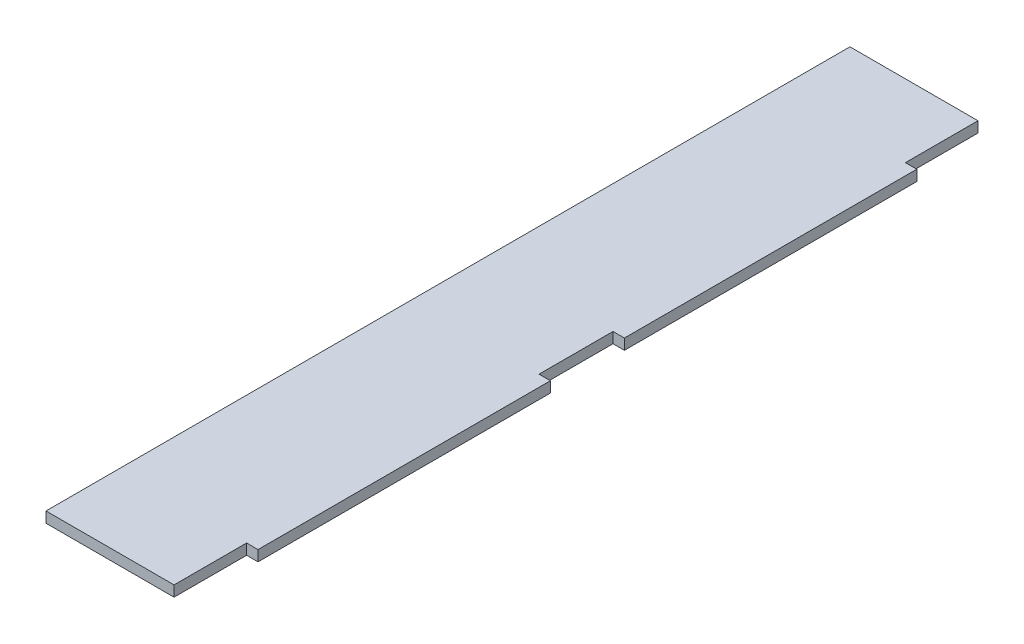
ISO-10303-21;
HEADER;
FILE_DESCRIPTION(('STEP AP214'),'2;1');
FILE_NAME('part.step','',(''),(''),'','','');
FILE_SCHEMA(('AUTOMOTIVE_DESIGN { 1 0 10303 214 1 1 1 1 }'));
ENDSEC;
DATA;
#1=APPLICATION_CONTEXT('core data for automotive mechanical design processes');
#2=APPLICATION_PROTOCOL_DEFINITION('international standard','automotive_design',2000,#1);
#3=PRODUCT_CONTEXT('',#1,'mechanical');
#4=PRODUCT('Part','Part','',(#3));
#5=PRODUCT_RELATED_PRODUCT_CATEGORY('part','',(#4));
#6=PRODUCT_DEFINITION_FORMATION('','',#4);
#7=PRODUCT_DEFINITION_CONTEXT('part definition',#1,'design');
#8=PRODUCT_DEFINITION('design','',#6,#7);
#9=PRODUCT_DEFINITION_SHAPE('','',#8);
#10=(LENGTH_UNIT() NAMED_UNIT(*) SI_UNIT(.MILLI.,.METRE.));
#11=(NAMED_UNIT(*) PLANE_ANGLE_UNIT() SI_UNIT($,.RADIAN.));
#12=(NAMED_UNIT(*) SI_UNIT($,.STERADIAN.) SOLID_ANGLE_UNIT());
#13=UNCERTAINTY_MEASURE_WITH_UNIT(LENGTH_MEASURE(1.E-05),#10,'distance_accuracy_value','');
#14=(GEOMETRIC_REPRESENTATION_CONTEXT(3) GLOBAL_UNCERTAINTY_ASSIGNED_CONTEXT((#13)) GLOBAL_UNIT_ASSIGNED_CONTEXT((#10,
#11,#12)) REPRESENTATION_CONTEXT('',''));
#15=CARTESIAN_POINT('',(0.,0.,0.));
#16=DIRECTION('',(0.,0.,1.));
#17=DIRECTION('',(1.,0.,0.));
#18=AXIS2_PLACEMENT_3D('',#15,#16,#17);
#19=CARTESIAN_POINT('',(18.,1.5,0.));
#20=DIRECTION('',(0.,0.,-1.));
#21=DIRECTION('',(-1.,0.,0.));
#22=AXIS2_PLACEMENT_3D('',#19,#20,#21);
#23=PLANE('',#22);
#24=DIRECTION('',(1.,0.,0.));
#25=VECTOR('',#24,1.);
#26=CARTESIAN_POINT('',(18.,0.,0.));
#27=LINE('',#26,#25);
#28=CARTESIAN_POINT('',(0.,0.,0.));
#29=VERTEX_POINT('',#28);
#30=CARTESIAN_POINT('',(18.,0.,0.));
#31=VERTEX_POINT('',#30);
#32=EDGE_CURVE('E153',#29,#31,#27,.T.);
#33=ORIENTED_EDGE('',*,*,#32,.T.);
#34=DIRECTION('',(0.,-1.,0.));
#35=VECTOR('',#34,1.);
#36=CARTESIAN_POINT('',(18.,1.5,0.));
#37=LINE('',#36,#35);
#38=CARTESIAN_POINT('',(18.,1.5,0.));
#39=VERTEX_POINT('',#38);
#40=EDGE_CURVE('E11',#39,#31,#37,.T.);
#41=ORIENTED_EDGE('',*,*,#40,.F.);
#42=DIRECTION('',(1.,0.,0.));
#43=VECTOR('',#42,1.);
#44=CARTESIAN_POINT('',(18.,1.5,0.));
#45=LINE('',#44,#43);
#46=CARTESIAN_POINT('',(0.,1.5,0.));
#47=VERTEX_POINT('',#46);
#48=EDGE_CURVE('E175',#47,#39,#45,.T.);
#49=ORIENTED_EDGE('',*,*,#48,.F.);
#50=DIRECTION('',(0.,-1.,0.));
#51=VECTOR('',#50,1.);
#52=CARTESIAN_POINT('',(0.,1.5,0.));
#53=LINE('',#52,#51);
#54=EDGE_CURVE('E149',#47,#29,#53,.T.);
#55=ORIENTED_EDGE('',*,*,#54,.T.);
#56=EDGE_LOOP('',(#33,#41,#49,#55));
#57=FACE_BOUND('',#56,.T.);
#58=ADVANCED_FACE('F33',(#57),#23,.F.);
#59=CARTESIAN_POINT('',(18.,1.5,-10.2));
#60=DIRECTION('',(-1.,0.,0.));
#61=DIRECTION('',(0.,0.,1.));
#62=AXIS2_PLACEMENT_3D('',#59,#60,#61);
#63=PLANE('',#62);
#64=DIRECTION('',(0.,0.,-1.));
#65=VECTOR('',#64,1.);
#66=CARTESIAN_POINT('',(18.,0.,-10.2));
#67=LINE('',#66,#65);
#68=CARTESIAN_POINT('',(18.,0.,-10.2));
#69=VERTEX_POINT('',#68);
#70=EDGE_CURVE('E156',#31,#69,#67,.T.);
#71=ORIENTED_EDGE('',*,*,#70,.T.);
#72=DIRECTION('',(0.,-1.,0.));
#73=VECTOR('',#72,1.);
#74=CARTESIAN_POINT('',(18.,1.5,-10.2));
#75=LINE('',#74,#73);
#76=CARTESIAN_POINT('',(18.,1.5,-10.2));
#77=VERTEX_POINT('',#76);
#78=EDGE_CURVE('E41',#77,#69,#75,.T.);
#79=ORIENTED_EDGE('',*,*,#78,.F.);
#80=DIRECTION('',(0.,0.,-1.));
#81=VECTOR('',#80,1.);
#82=CARTESIAN_POINT('',(18.,1.5,-10.2));
#83=LINE('',#82,#81);
#84=EDGE_CURVE('E104',#39,#77,#83,.T.);
#85=ORIENTED_EDGE('',*,*,#84,.F.);
#86=ORIENTED_EDGE('',*,*,#40,.T.);
#87=EDGE_LOOP('',(#71,#79,#85,#86));
#88=FACE_BOUND('',#87,.T.);
#89=ADVANCED_FACE('F253',(#88),#63,.F.);
#90=CARTESIAN_POINT('',(19.6,1.5,-10.2));
#91=DIRECTION('',(0.,0.,-1.));
#92=DIRECTION('',(-1.,0.,0.));
#93=AXIS2_PLACEMENT_3D('',#90,#91,#92);
#94=PLANE('',#93);
#95=DIRECTION('',(1.,0.,0.));
#96=VECTOR('',#95,1.);
#97=CARTESIAN_POINT('',(19.6,0.,-10.2));
#98=LINE('',#97,#96);
#99=CARTESIAN_POINT('',(19.6,0.,-10.2));
#100=VERTEX_POINT('',#99);
#101=EDGE_CURVE('E158',#69,#100,#98,.T.);
#102=ORIENTED_EDGE('',*,*,#101,.T.);
#103=DIRECTION('',(0.,-1.,0.));
#104=VECTOR('',#103,1.);
#105=CARTESIAN_POINT('',(19.6,1.5,-10.2));
#106=LINE('',#105,#104);
#107=CARTESIAN_POINT('',(19.6,1.5,-10.2));
#108=VERTEX_POINT('',#107);
#109=EDGE_CURVE('E194',#108,#100,#106,.T.);
#110=ORIENTED_EDGE('',*,*,#109,.F.);
#111=DIRECTION('',(1.,0.,0.));
#112=VECTOR('',#111,1.);
#113=CARTESIAN_POINT('',(19.6,1.5,-10.2));
#114=LINE('',#113,#112);
#115=EDGE_CURVE('E202',#77,#108,#114,.T.);
#116=ORIENTED_EDGE('',*,*,#115,.F.);
#117=ORIENTED_EDGE('',*,*,#78,.T.);
#118=EDGE_LOOP('',(#102,#110,#116,#117));
#119=FACE_BOUND('',#118,.T.);
#120=ADVANCED_FACE('F200',(#119),#94,.F.);
#121=CARTESIAN_POINT('',(19.6,1.5,-51.3));
#122=DIRECTION('',(-1.,0.,0.));
#123=DIRECTION('',(0.,0.,1.));
#124=AXIS2_PLACEMENT_3D('',#121,#122,#123);
#125=PLANE('',#124);
#126=DIRECTION('',(0.,0.,-1.));
#127=VECTOR('',#126,1.);
#128=CARTESIAN_POINT('',(19.6,0.,-51.3));
#129=LINE('',#128,#127);
#130=CARTESIAN_POINT('',(19.6,0.,-51.3));
#131=VERTEX_POINT('',#130);
#132=EDGE_CURVE('E160',#100,#131,#129,.T.);
#133=ORIENTED_EDGE('',*,*,#132,.T.);
#134=DIRECTION('',(0.,-1.,0.));
#135=VECTOR('',#134,1.);
#136=CARTESIAN_POINT('',(19.6,1.5,-51.3));
#137=LINE('',#136,#135);
#138=CARTESIAN_POINT('',(19.6,1.5,-51.3));
#139=VERTEX_POINT('',#138);
#140=EDGE_CURVE('E191',#139,#131,#137,.T.);
#141=ORIENTED_EDGE('',*,*,#140,.F.);
#142=DIRECTION('',(0.,0.,-1.));
#143=VECTOR('',#142,1.);
#144=CARTESIAN_POINT('',(19.6,1.5,-51.3));
#145=LINE('',#144,#143);
#146=EDGE_CURVE('E220',#108,#139,#145,.T.);
#147=ORIENTED_EDGE('',*,*,#146,.F.);
#148=ORIENTED_EDGE('',*,*,#109,.T.);
#149=EDGE_LOOP('',(#133,#141,#147,#148));
#150=FACE_BOUND('',#149,.T.);
#151=ADVANCED_FACE('F211',(#150),#125,.F.);
#152=CARTESIAN_POINT('',(18.,1.5,-51.3));
#153=DIRECTION('',(0.,0.,1.));
#154=DIRECTION('',(1.,0.,0.));
#155=AXIS2_PLACEMENT_3D('',#152,#153,#154);
#156=PLANE('',#155);
#157=DIRECTION('',(-1.,0.,0.));
#158=VECTOR('',#157,1.);
#159=CARTESIAN_POINT('',(18.,0.,-51.3));
#160=LINE('',#159,#158);
#161=CARTESIAN_POINT('',(18.,0.,-51.3));
#162=VERTEX_POINT('',#161);
#163=EDGE_CURVE('E162',#131,#162,#160,.T.);
#164=ORIENTED_EDGE('',*,*,#163,.T.);
#165=DIRECTION('',(0.,-1.,0.));
#166=VECTOR('',#165,1.);
#167=CARTESIAN_POINT('',(18.,1.5,-51.3));
#168=LINE('',#167,#166);
#169=CARTESIAN_POINT('',(18.,1.5,-51.3));
#170=VERTEX_POINT('',#169);
#171=EDGE_CURVE('E188',#170,#162,#168,.T.);
#172=ORIENTED_EDGE('',*,*,#171,.F.);
#173=DIRECTION('',(-1.,0.,0.));
#174=VECTOR('',#173,1.);
#175=CARTESIAN_POINT('',(18.,1.5,-51.3));
#176=LINE('',#175,#174);
#177=EDGE_CURVE('E217',#139,#170,#176,.T.);
#178=ORIENTED_EDGE('',*,*,#177,.F.);
#179=ORIENTED_EDGE('',*,*,#140,.T.);
#180=EDGE_LOOP('',(#164,#172,#178,#179));
#181=FACE_BOUND('',#180,.T.);
#182=ADVANCED_FACE('F215',(#181),#156,.F.);
#183=CARTESIAN_POINT('',(18.,1.5,-61.7));
#184=DIRECTION('',(-1.,0.,0.));
#185=DIRECTION('',(0.,0.,1.));
#186=AXIS2_PLACEMENT_3D('',#183,#184,#185);
#187=PLANE('',#186);
#188=DIRECTION('',(0.,0.,-1.));
#189=VECTOR('',#188,1.);
#190=CARTESIAN_POINT('',(18.,0.,-61.7));
#191=LINE('',#190,#189);
#192=CARTESIAN_POINT('',(18.,0.,-61.7));
#193=VERTEX_POINT('',#192);
#194=EDGE_CURVE('E164',#162,#193,#191,.T.);
#195=ORIENTED_EDGE('',*,*,#194,.T.);
#196=DIRECTION('',(0.,-1.,0.));
#197=VECTOR('',#196,1.);
#198=CARTESIAN_POINT('',(18.,1.5,-61.7));
#199=LINE('',#198,#197);
#200=CARTESIAN_POINT('',(18.,1.5,-61.7));
#201=VERTEX_POINT('',#200);
#202=EDGE_CURVE('E185',#201,#193,#199,.T.);
#203=ORIENTED_EDGE('',*,*,#202,.F.);
#204=DIRECTION('',(0.,0.,-1.));
#205=VECTOR('',#204,1.);
#206=CARTESIAN_POINT('',(18.,1.5,-61.7));
#207=LINE('',#206,#205);
#208=EDGE_CURVE('E219',#170,#201,#207,.T.);
#209=ORIENTED_EDGE('',*,*,#208,.F.);
#210=ORIENTED_EDGE('',*,*,#171,.T.);
#211=EDGE_LOOP('',(#195,#203,#209,#210));
#212=FACE_BOUND('',#211,.T.);
#213=ADVANCED_FACE('F266',(#212),#187,.F.);
#214=CARTESIAN_POINT('',(19.6,1.5,-61.7));
#215=DIRECTION('',(0.,0.,-1.));
#216=DIRECTION('',(-1.,0.,0.));
#217=AXIS2_PLACEMENT_3D('',#214,#215,#216);
#218=PLANE('',#217);
#219=DIRECTION('',(1.,0.,0.));
#220=VECTOR('',#219,1.);
#221=CARTESIAN_POINT('',(19.6,0.,-61.7));
#222=LINE('',#221,#220);
#223=CARTESIAN_POINT('',(19.6,0.,-61.7));
#224=VERTEX_POINT('',#223);
#225=EDGE_CURVE('E166',#193,#224,#222,.T.);
#226=ORIENTED_EDGE('',*,*,#225,.T.);
#227=DIRECTION('',(0.,-1.,0.));
#228=VECTOR('',#227,1.);
#229=CARTESIAN_POINT('',(19.6,1.5,-61.7));
#230=LINE('',#229,#228);
#231=CARTESIAN_POINT('',(19.6,1.5,-61.7));
#232=VERTEX_POINT('',#231);
#233=EDGE_CURVE('E182',#232,#224,#230,.T.);
#234=ORIENTED_EDGE('',*,*,#233,.F.);
#235=DIRECTION('',(1.,0.,0.));
#236=VECTOR('',#235,1.);
#237=CARTESIAN_POINT('',(19.6,1.5,-61.7));
#238=LINE('',#237,#236);
#239=EDGE_CURVE('E222',#201,#232,#238,.T.);
#240=ORIENTED_EDGE('',*,*,#239,.F.);
#241=ORIENTED_EDGE('',*,*,#202,.T.);
#242=EDGE_LOOP('',(#226,#234,#240,#241));
#243=FACE_BOUND('',#242,.T.);
#244=ADVANCED_FACE('F269',(#243),#218,.F.);
#245=CARTESIAN_POINT('',(19.6,1.5,-102.8));
#246=DIRECTION('',(-1.,0.,0.));
#247=DIRECTION('',(0.,0.,1.));
#248=AXIS2_PLACEMENT_3D('',#245,#246,#247);
#249=PLANE('',#248);
#250=DIRECTION('',(0.,0.,-1.));
#251=VECTOR('',#250,1.);
#252=CARTESIAN_POINT('',(19.6,0.,-102.8));
#253=LINE('',#252,#251);
#254=CARTESIAN_POINT('',(19.6,0.,-102.8));
#255=VERTEX_POINT('',#254);
#256=EDGE_CURVE('E168',#224,#255,#253,.T.);
#257=ORIENTED_EDGE('',*,*,#256,.T.);
#258=DIRECTION('',(0.,-1.,0.));
#259=VECTOR('',#258,1.);
#260=CARTESIAN_POINT('',(19.6,1.5,-102.8));
#261=LINE('',#260,#259);
#262=CARTESIAN_POINT('',(19.6,1.5,-102.8));
#263=VERTEX_POINT('',#262);
#264=EDGE_CURVE('E179',#263,#255,#261,.T.);
#265=ORIENTED_EDGE('',*,*,#264,.F.);
#266=DIRECTION('',(0.,0.,-1.));
#267=VECTOR('',#266,1.);
#268=CARTESIAN_POINT('',(19.6,1.5,-102.8));
#269=LINE('',#268,#267);
#270=EDGE_CURVE('E228',#232,#263,#269,.T.);
#271=ORIENTED_EDGE('',*,*,#270,.F.);
#272=ORIENTED_EDGE('',*,*,#233,.T.);
#273=EDGE_LOOP('',(#257,#265,#271,#272));
#274=FACE_BOUND('',#273,.T.);
#275=ADVANCED_FACE('F234',(#274),#249,.F.);
#276=CARTESIAN_POINT('',(18.,1.5,-102.8));
#277=DIRECTION('',(0.,0.,1.));
#278=DIRECTION('',(1.,0.,0.));
#279=AXIS2_PLACEMENT_3D('',#276,#277,#278);
#280=PLANE('',#279);
#281=DIRECTION('',(-1.,0.,0.));
#282=VECTOR('',#281,1.);
#283=CARTESIAN_POINT('',(18.,0.,-102.8));
#284=LINE('',#283,#282);
#285=CARTESIAN_POINT('',(18.,0.,-102.8));
#286=VERTEX_POINT('',#285);
#287=EDGE_CURVE('E170',#255,#286,#284,.T.);
#288=ORIENTED_EDGE('',*,*,#287,.T.);
#289=DIRECTION('',(0.,-1.,0.));
#290=VECTOR('',#289,1.);
#291=CARTESIAN_POINT('',(18.,1.5,-102.8));
#292=LINE('',#291,#290);
#293=CARTESIAN_POINT('',(18.,1.5,-102.8));
#294=VERTEX_POINT('',#293);
#295=EDGE_CURVE('E144',#294,#286,#292,.T.);
#296=ORIENTED_EDGE('',*,*,#295,.F.);
#297=DIRECTION('',(-1.,0.,0.));
#298=VECTOR('',#297,1.);
#299=CARTESIAN_POINT('',(18.,1.5,-102.8));
#300=LINE('',#299,#298);
#301=EDGE_CURVE('E135',#263,#294,#300,.T.);
#302=ORIENTED_EDGE('',*,*,#301,.F.);
#303=ORIENTED_EDGE('',*,*,#264,.T.);
#304=EDGE_LOOP('',(#288,#296,#302,#303));
#305=FACE_BOUND('',#304,.T.);
#306=ADVANCED_FACE('F238',(#305),#280,.F.);
#307=CARTESIAN_POINT('',(18.,1.5,-113.));
#308=DIRECTION('',(-1.,0.,0.));
#309=DIRECTION('',(0.,0.,1.));
#310=AXIS2_PLACEMENT_3D('',#307,#308,#309);
#311=PLANE('',#310);
#312=DIRECTION('',(0.,0.,-1.));
#313=VECTOR('',#312,1.);
#314=CARTESIAN_POINT('',(18.,0.,-113.));
#315=LINE('',#314,#313);
#316=CARTESIAN_POINT('',(18.,0.,-113.));
#317=VERTEX_POINT('',#316);
#318=EDGE_CURVE('E143',#286,#317,#315,.T.);
#319=ORIENTED_EDGE('',*,*,#318,.T.);
#320=DIRECTION('',(0.,-1.,0.));
#321=VECTOR('',#320,1.);
#322=CARTESIAN_POINT('',(18.,1.5,-113.));
#323=LINE('',#322,#321);
#324=CARTESIAN_POINT('',(18.,1.5,-113.));
#325=VERTEX_POINT('',#324);
#326=EDGE_CURVE('E140',#325,#317,#323,.T.);
#327=ORIENTED_EDGE('',*,*,#326,.F.);
#328=DIRECTION('',(0.,0.,-1.));
#329=VECTOR('',#328,1.);
#330=CARTESIAN_POINT('',(18.,1.5,-113.));
#331=LINE('',#330,#329);
#332=EDGE_CURVE('E129',#294,#325,#331,.T.);
#333=ORIENTED_EDGE('',*,*,#332,.F.);
#334=ORIENTED_EDGE('',*,*,#295,.T.);
#335=EDGE_LOOP('',(#319,#327,#333,#334));
#336=FACE_BOUND('',#335,.T.);
#337=ADVANCED_FACE('F141',(#336),#311,.F.);
#338=CARTESIAN_POINT('',(18.,1.5,-113.));
#339=DIRECTION('',(0.,0.,1.));
#340=DIRECTION('',(1.,0.,0.));
#341=AXIS2_PLACEMENT_3D('',#338,#339,#340);
#342=PLANE('',#341);
#343=DIRECTION('',(-1.,0.,0.));
#344=VECTOR('',#343,1.);
#345=CARTESIAN_POINT('',(18.,0.,-113.));
#346=LINE('',#345,#344);
#347=CARTESIAN_POINT('',(0.,0.,-113.));
#348=VERTEX_POINT('',#347);
#349=EDGE_CURVE('E90',#317,#348,#346,.T.);
#350=ORIENTED_EDGE('',*,*,#349,.T.);
#351=DIRECTION('',(0.,-1.,0.));
#352=VECTOR('',#351,1.);
#353=CARTESIAN_POINT('',(0.,1.5,-113.));
#354=LINE('',#353,#352);
#355=CARTESIAN_POINT('',(0.,1.5,-113.));
#356=VERTEX_POINT('',#355);
#357=EDGE_CURVE('E145',#356,#348,#354,.T.);
#358=ORIENTED_EDGE('',*,*,#357,.F.);
#359=DIRECTION('',(-1.,0.,0.));
#360=VECTOR('',#359,1.);
#361=CARTESIAN_POINT('',(18.,1.5,-113.));
#362=LINE('',#361,#360);
#363=EDGE_CURVE('E133',#325,#356,#362,.T.);
#364=ORIENTED_EDGE('',*,*,#363,.F.);
#365=ORIENTED_EDGE('',*,*,#326,.T.);
#366=EDGE_LOOP('',(#350,#358,#364,#365));
#367=FACE_BOUND('',#366,.T.);
#368=ADVANCED_FACE('F147',(#367),#342,.F.);
#369=CARTESIAN_POINT('',(0.,1.5,0.));
#370=DIRECTION('',(1.,0.,0.));
#371=DIRECTION('',(0.,0.,-1.));
#372=AXIS2_PLACEMENT_3D('',#369,#370,#371);
#373=PLANE('',#372);
#374=DIRECTION('',(0.,0.,1.));
#375=VECTOR('',#374,1.);
#376=CARTESIAN_POINT('',(0.,0.,0.));
#377=LINE('',#376,#375);
#378=EDGE_CURVE('E96',#348,#29,#377,.T.);
#379=ORIENTED_EDGE('',*,*,#378,.T.);
#380=ORIENTED_EDGE('',*,*,#54,.F.);
#381=DIRECTION('',(0.,0.,1.));
#382=VECTOR('',#381,1.);
#383=CARTESIAN_POINT('',(0.,1.5,0.));
#384=LINE('',#383,#382);
#385=EDGE_CURVE('E49',#356,#47,#384,.T.);
#386=ORIENTED_EDGE('',*,*,#385,.F.);
#387=ORIENTED_EDGE('',*,*,#357,.T.);
#388=EDGE_LOOP('',(#379,#380,#386,#387));
#389=FACE_BOUND('',#388,.T.);
#390=ADVANCED_FACE('F242',(#389),#373,.F.);
#391=CARTESIAN_POINT('',(0.,1.5,0.));
#392=DIRECTION('',(0.,-1.,0.));
#393=DIRECTION('',(0.,0.,-1.));
#394=AXIS2_PLACEMENT_3D('',#391,#392,#393);
#395=PLANE('',#394);
#396=ORIENTED_EDGE('',*,*,#48,.T.);
#397=ORIENTED_EDGE('',*,*,#84,.T.);
#398=ORIENTED_EDGE('',*,*,#115,.T.);
#399=ORIENTED_EDGE('',*,*,#146,.T.);
#400=ORIENTED_EDGE('',*,*,#177,.T.);
#401=ORIENTED_EDGE('',*,*,#208,.T.);
#402=ORIENTED_EDGE('',*,*,#239,.T.);
#403=ORIENTED_EDGE('',*,*,#270,.T.);
#404=ORIENTED_EDGE('',*,*,#301,.T.);
#405=ORIENTED_EDGE('',*,*,#332,.T.);
#406=ORIENTED_EDGE('',*,*,#363,.T.);
#407=ORIENTED_EDGE('',*,*,#385,.T.);
#408=EDGE_LOOP('',(#396,#397,#398,#399,#400,#401,#402,#403,#404,#405,#406,#407));
#409=FACE_BOUND('',#408,.T.);
#410=ADVANCED_FACE('F131',(#409),#395,.F.);
#411=CARTESIAN_POINT('',(0.,0.,0.));
#412=DIRECTION('',(0.,-1.,0.));
#413=DIRECTION('',(0.,0.,-1.));
#414=AXIS2_PLACEMENT_3D('',#411,#412,#413);
#415=PLANE('',#414);
#416=ORIENTED_EDGE('',*,*,#32,.F.);
#417=ORIENTED_EDGE('',*,*,#378,.F.);
#418=ORIENTED_EDGE('',*,*,#349,.F.);
#419=ORIENTED_EDGE('',*,*,#318,.F.);
#420=ORIENTED_EDGE('',*,*,#287,.F.);
#421=ORIENTED_EDGE('',*,*,#256,.F.);
#422=ORIENTED_EDGE('',*,*,#225,.F.);
#423=ORIENTED_EDGE('',*,*,#194,.F.);
#424=ORIENTED_EDGE('',*,*,#163,.F.);
#425=ORIENTED_EDGE('',*,*,#132,.F.);
#426=ORIENTED_EDGE('',*,*,#101,.F.);
#427=ORIENTED_EDGE('',*,*,#70,.F.);
#428=EDGE_LOOP('',(#416,#417,#418,#419,#420,#421,#422,#423,#424,#425,#426,#427));
#429=FACE_BOUND('',#428,.T.);
#430=ADVANCED_FACE('F206',(#429),#415,.T.);
#431=CLOSED_SHELL('',(#58,#89,#120,#151,#182,#213,#244,#275,#306,#337,#368,#390,#410,#430));
#432=MANIFOLD_SOLID_BREP('B2',#431);
#433=ADVANCED_BREP_SHAPE_REPRESENTATION('',(#18,#432),#14);
#434=SHAPE_DEFINITION_REPRESENTATION(#9,#433);
ENDSEC;
END-ISO-10303-21;
